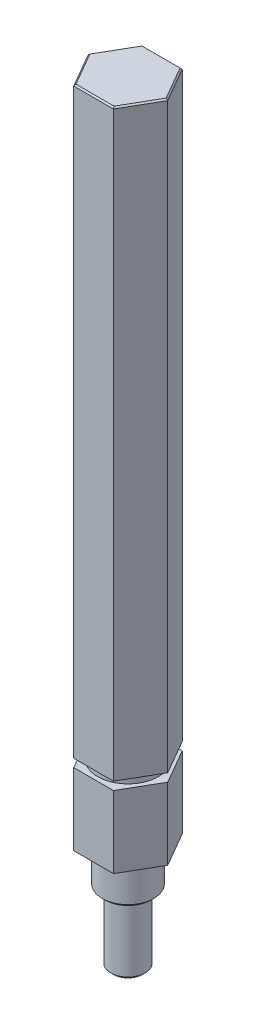
ISO-10303-21;
HEADER;
FILE_DESCRIPTION(('STEP AP214'),'2;1');
FILE_NAME('part.step','',(''),(''),'','','');
FILE_SCHEMA(('AUTOMOTIVE_DESIGN { 1 0 10303 214 1 1 1 1 }'));
ENDSEC;
DATA;
#1=APPLICATION_CONTEXT('core data for automotive mechanical design processes');
#2=APPLICATION_PROTOCOL_DEFINITION('international standard','automotive_design',2000,#1);
#3=PRODUCT_CONTEXT('',#1,'mechanical');
#4=PRODUCT('Part','Part','',(#3));
#5=PRODUCT_RELATED_PRODUCT_CATEGORY('part','',(#4));
#6=PRODUCT_DEFINITION_FORMATION('','',#4);
#7=PRODUCT_DEFINITION_CONTEXT('part definition',#1,'design');
#8=PRODUCT_DEFINITION('design','',#6,#7);
#9=PRODUCT_DEFINITION_SHAPE('','',#8);
#10=(LENGTH_UNIT() NAMED_UNIT(*) SI_UNIT(.MILLI.,.METRE.));
#11=(NAMED_UNIT(*) PLANE_ANGLE_UNIT() SI_UNIT($,.RADIAN.));
#12=(NAMED_UNIT(*) SI_UNIT($,.STERADIAN.) SOLID_ANGLE_UNIT());
#13=UNCERTAINTY_MEASURE_WITH_UNIT(LENGTH_MEASURE(1.E-05),#10,'distance_accuracy_value','');
#14=(GEOMETRIC_REPRESENTATION_CONTEXT(3) GLOBAL_UNCERTAINTY_ASSIGNED_CONTEXT((#13)) GLOBAL_UNIT_ASSIGNED_CONTEXT((#10,
#11,#12)) REPRESENTATION_CONTEXT('',''));
#15=CARTESIAN_POINT('',(0.,0.,0.));
#16=DIRECTION('',(0.,0.,1.));
#17=DIRECTION('',(1.,0.,0.));
#18=AXIS2_PLACEMENT_3D('',#15,#16,#17);
#19=CARTESIAN_POINT('',(-38.3071337161431,-45.212,-16.669011646302));
#20=DIRECTION('',(0.,1.,0.));
#21=DIRECTION('',(0.,0.,1.));
#22=AXIS2_PLACEMENT_3D('',#19,#20,#21);
#23=PLANE('',#22);
#24=CARTESIAN_POINT('',(-38.3071337161431,-45.2119999999923,-16.669011646302));
#25=DIRECTION('',(0.,1.,0.));
#26=DIRECTION('',(0.,0.,1.));
#27=AXIS2_PLACEMENT_3D('',#24,#25,#26);
#28=CIRCLE('',#27,2.65430000009029);
#29=CARTESIAN_POINT('',(-38.3071337161431,-45.2119999999923,-14.0147116462117));
#30=VERTEX_POINT('',#29);
#31=EDGE_CURVE('E19',#30,#30,#28,.T.);
#32=ORIENTED_EDGE('',*,*,#31,.F.);
#33=EDGE_LOOP('',(#32));
#34=FACE_BOUND('',#33,.T.);
#35=ADVANCED_FACE('F16',(#34),#23,.F.);
#36=CARTESIAN_POINT('',(-38.3071337161431,-44.704000000138,-16.669011646302));
#37=DIRECTION('',(0.,1.,0.));
#38=DIRECTION('',(0.,0.,1.));
#39=AXIS2_PLACEMENT_3D('',#36,#37,#38);
#40=CONICAL_SURFACE('',#39,3.16229999994458,0.785398163397448);
#41=CARTESIAN_POINT('',(-38.3071337161431,-44.704,-16.669011646302));
#42=DIRECTION('',(0.,1.,0.));
#43=DIRECTION('',(0.,0.,1.));
#44=AXIS2_PLACEMENT_3D('',#41,#42,#43);
#45=CIRCLE('',#44,3.1623);
#46=CARTESIAN_POINT('',(-38.3071337161431,-44.704,-13.506711646302));
#47=VERTEX_POINT('',#46);
#48=EDGE_CURVE('E178',#47,#47,#45,.T.);
#49=ORIENTED_EDGE('',*,*,#48,.F.);
#50=EDGE_LOOP('',(#49));
#51=FACE_BOUND('',#50,.T.);
#52=ORIENTED_EDGE('',*,*,#31,.T.);
#53=EDGE_LOOP('',(#52));
#54=FACE_BOUND('',#53,.T.);
#55=ADVANCED_FACE('F220',(#51,#54),#40,.T.);
#56=CARTESIAN_POINT('',(-38.3071337161431,-45.212,-16.669011646302));
#57=DIRECTION('',(0.,1.,0.));
#58=DIRECTION('',(0.,0.,1.));
#59=AXIS2_PLACEMENT_3D('',#56,#57,#58);
#60=CYLINDRICAL_SURFACE('',#59,3.1623);
#61=CARTESIAN_POINT('',(-38.3071337161431,-32.512,-16.669011646302));
#62=DIRECTION('',(0.,1.,0.));
#63=DIRECTION('',(0.,0.,1.));
#64=AXIS2_PLACEMENT_3D('',#61,#62,#63);
#65=CIRCLE('',#64,3.1623);
#66=CARTESIAN_POINT('',(-38.3071337161431,-32.512,-13.506711646302));
#67=VERTEX_POINT('',#66);
#68=EDGE_CURVE('E182',#67,#67,#65,.F.);
#69=ORIENTED_EDGE('',*,*,#68,.T.);
#70=EDGE_LOOP('',(#69));
#71=FACE_BOUND('',#70,.T.);
#72=ORIENTED_EDGE('',*,*,#48,.T.);
#73=EDGE_LOOP('',(#72));
#74=FACE_BOUND('',#73,.T.);
#75=ADVANCED_FACE('F204',(#71,#74),#60,.T.);
#76=CARTESIAN_POINT('',(-38.3071337161431,-32.512,-16.669011646302));
#77=DIRECTION('',(0.,1.,0.));
#78=DIRECTION('',(0.,0.,1.));
#79=AXIS2_PLACEMENT_3D('',#76,#77,#78);
#80=PLANE('',#79);
#81=CARTESIAN_POINT('',(-38.3071337161431,-32.511999999997,-16.669011646302));
#82=DIRECTION('',(0.,1.,0.));
#83=DIRECTION('',(0.,0.,1.));
#84=AXIS2_PLACEMENT_3D('',#81,#82,#83);
#85=CIRCLE('',#84,4.24179999994759);
#86=CARTESIAN_POINT('',(-38.3071337161431,-32.511999999997,-12.4272116463544));
#87=VERTEX_POINT('',#86);
#88=EDGE_CURVE('E177',#87,#87,#85,.T.);
#89=ORIENTED_EDGE('',*,*,#88,.F.);
#90=EDGE_LOOP('',(#89));
#91=FACE_BOUND('',#90,.T.);
#92=ORIENTED_EDGE('',*,*,#68,.F.);
#93=EDGE_LOOP('',(#92));
#94=FACE_BOUND('',#93,.T.);
#95=ADVANCED_FACE('F207',(#91,#94),#80,.F.);
#96=CARTESIAN_POINT('',(-38.3071337161431,-32.0039999999722,-16.669011646302));
#97=DIRECTION('',(0.,1.,0.));
#98=DIRECTION('',(0.,0.,1.));
#99=AXIS2_PLACEMENT_3D('',#96,#97,#98);
#100=CONICAL_SURFACE('',#99,4.74979999991557,0.7853981633415);
#101=CARTESIAN_POINT('',(-38.3071337161431,-32.004,-16.669011646302));
#102=DIRECTION('',(0.,1.,0.));
#103=DIRECTION('',(0.,0.,1.));
#104=AXIS2_PLACEMENT_3D('',#101,#102,#103);
#105=CIRCLE('',#104,4.7498);
#106=CARTESIAN_POINT('',(-38.3071337161431,-32.004,-11.919211646302));
#107=VERTEX_POINT('',#106);
#108=EDGE_CURVE('E173',#107,#107,#105,.T.);
#109=ORIENTED_EDGE('',*,*,#108,.F.);
#110=EDGE_LOOP('',(#109));
#111=FACE_BOUND('',#110,.T.);
#112=ORIENTED_EDGE('',*,*,#88,.T.);
#113=EDGE_LOOP('',(#112));
#114=FACE_BOUND('',#113,.T.);
#115=ADVANCED_FACE('F209',(#111,#114),#100,.T.);
#116=CARTESIAN_POINT('',(-38.3071337161431,-32.512,-16.669011646302));
#117=DIRECTION('',(0.,1.,0.));
#118=DIRECTION('',(0.,0.,1.));
#119=AXIS2_PLACEMENT_3D('',#116,#117,#118);
#120=CYLINDRICAL_SURFACE('',#119,4.7498);
#121=CARTESIAN_POINT('',(-38.3071337161431,-25.4,-16.669011646302));
#122=DIRECTION('',(0.,1.,0.));
#123=DIRECTION('',(0.,0.,1.));
#124=AXIS2_PLACEMENT_3D('',#121,#122,#123);
#125=CIRCLE('',#124,4.7498);
#126=CARTESIAN_POINT('',(-38.3071337161431,-25.4,-11.919211646302));
#127=VERTEX_POINT('',#126);
#128=EDGE_CURVE('E152',#127,#127,#125,.F.);
#129=ORIENTED_EDGE('',*,*,#128,.T.);
#130=EDGE_LOOP('',(#129));
#131=FACE_BOUND('',#130,.T.);
#132=ORIENTED_EDGE('',*,*,#108,.T.);
#133=EDGE_LOOP('',(#132));
#134=FACE_BOUND('',#133,.T.);
#135=ADVANCED_FACE('F217',(#131,#134),#120,.T.);
#136=CARTESIAN_POINT('',(-38.3071337161431,-25.4,-3.96901164630201));
#137=DIRECTION('',(0.,1.,0.));
#138=DIRECTION('',(0.,0.,1.));
#139=AXIS2_PLACEMENT_3D('',#136,#137,#138);
#140=PLANE('',#139);
#141=DIRECTION('',(-0.5,0.,0.866025403784439));
#142=VECTOR('',#141,1.);
#143=CARTESIAN_POINT('',(-41.9733079254973,-25.4,-23.019011646302));
#144=LINE('',#143,#142);
#145=CARTESIAN_POINT('',(-41.9733079254973,-25.4,-23.019011646302));
#146=VERTEX_POINT('',#145);
#147=CARTESIAN_POINT('',(-45.6394821348514,-25.4,-16.669011646302));
#148=VERTEX_POINT('',#147);
#149=EDGE_CURVE('E143',#146,#148,#144,.T.);
#150=ORIENTED_EDGE('',*,*,#149,.F.);
#151=DIRECTION('',(-1.,0.,0.));
#152=VECTOR('',#151,1.);
#153=CARTESIAN_POINT('',(-34.640959506789,-25.4,-23.019011646302));
#154=LINE('',#153,#152);
#155=CARTESIAN_POINT('',(-34.640959506789,-25.4,-23.019011646302));
#156=VERTEX_POINT('',#155);
#157=EDGE_CURVE('E139',#156,#146,#154,.T.);
#158=ORIENTED_EDGE('',*,*,#157,.F.);
#159=DIRECTION('',(-0.5,0.,-0.866025403784439));
#160=VECTOR('',#159,1.);
#161=CARTESIAN_POINT('',(-30.9747852974349,-25.4,-16.669011646302));
#162=LINE('',#161,#160);
#163=CARTESIAN_POINT('',(-30.9747852974349,-25.4,-16.669011646302));
#164=VERTEX_POINT('',#163);
#165=EDGE_CURVE('E162',#164,#156,#162,.T.);
#166=ORIENTED_EDGE('',*,*,#165,.F.);
#167=DIRECTION('',(0.500000000000001,0.,-0.866025403784438));
#168=VECTOR('',#167,1.);
#169=CARTESIAN_POINT('',(-34.640959506789,-25.4,-10.319011646302));
#170=LINE('',#169,#168);
#171=CARTESIAN_POINT('',(-34.640959506789,-25.4,-10.319011646302));
#172=VERTEX_POINT('',#171);
#173=EDGE_CURVE('E524',#172,#164,#170,.T.);
#174=ORIENTED_EDGE('',*,*,#173,.F.);
#175=DIRECTION('',(1.,0.,0.));
#176=VECTOR('',#175,1.);
#177=CARTESIAN_POINT('',(-41.9733079254973,-25.4,-10.319011646302));
#178=LINE('',#177,#176);
#179=CARTESIAN_POINT('',(-41.9733079254973,-25.4,-10.319011646302));
#180=VERTEX_POINT('',#179);
#181=EDGE_CURVE('E531',#180,#172,#178,.T.);
#182=ORIENTED_EDGE('',*,*,#181,.F.);
#183=DIRECTION('',(0.5,0.,0.866025403784439));
#184=VECTOR('',#183,1.);
#185=CARTESIAN_POINT('',(-45.6394821348514,-25.4,-16.669011646302));
#186=LINE('',#185,#184);
#187=EDGE_CURVE('E148',#148,#180,#186,.T.);
#188=ORIENTED_EDGE('',*,*,#187,.F.);
#189=EDGE_LOOP('',(#150,#158,#166,#174,#182,#188));
#190=FACE_BOUND('',#189,.T.);
#191=ORIENTED_EDGE('',*,*,#128,.F.);
#192=EDGE_LOOP('',(#191));
#193=FACE_BOUND('',#192,.T.);
#194=ADVANCED_FACE('F145',(#190,#193),#140,.F.);
#195=CARTESIAN_POINT('',(-41.9733079254973,-25.4,-23.019011646302));
#196=DIRECTION('',(-0.866025403784439,0.,-0.5));
#197=DIRECTION('',(-0.5,0.,0.866025403784439));
#198=AXIS2_PLACEMENT_3D('',#195,#196,#197);
#199=PLANE('',#198);
#200=ORIENTED_EDGE('',*,*,#149,.T.);
#201=DIRECTION('',(0.,1.,0.));
#202=VECTOR('',#201,1.);
#203=CARTESIAN_POINT('',(-45.6394821348514,-25.4,-16.669011646302));
#204=LINE('',#203,#202);
#205=CARTESIAN_POINT('',(-45.6394821348514,-12.1158,-16.669011646302));
#206=VERTEX_POINT('',#205);
#207=EDGE_CURVE('E539',#206,#148,#204,.F.);
#208=ORIENTED_EDGE('',*,*,#207,.F.);
#209=DIRECTION('',(0.5,0.,-0.866025403784439));
#210=VECTOR('',#209,1.);
#211=CARTESIAN_POINT('',(-45.6394821348514,-12.1158,-16.669011646302));
#212=LINE('',#211,#210);
#213=CARTESIAN_POINT('',(-41.9733079254973,-12.1158,-23.019011646302));
#214=VERTEX_POINT('',#213);
#215=EDGE_CURVE('E158',#206,#214,#212,.T.);
#216=ORIENTED_EDGE('',*,*,#215,.T.);
#217=DIRECTION('',(0.,1.,0.));
#218=VECTOR('',#217,1.);
#219=CARTESIAN_POINT('',(-41.9733079254973,-25.4,-23.019011646302));
#220=LINE('',#219,#218);
#221=EDGE_CURVE('E155',#146,#214,#220,.T.);
#222=ORIENTED_EDGE('',*,*,#221,.F.);
#223=EDGE_LOOP('',(#200,#208,#216,#222));
#224=FACE_BOUND('',#223,.T.);
#225=ADVANCED_FACE('F156',(#224),#199,.T.);
#226=CARTESIAN_POINT('',(-34.640959506789,-25.4,-23.019011646302));
#227=DIRECTION('',(0.,0.,-1.));
#228=DIRECTION('',(-1.,0.,0.));
#229=AXIS2_PLACEMENT_3D('',#226,#227,#228);
#230=PLANE('',#229);
#231=ORIENTED_EDGE('',*,*,#157,.T.);
#232=ORIENTED_EDGE('',*,*,#221,.T.);
#233=DIRECTION('',(1.,0.,0.));
#234=VECTOR('',#233,1.);
#235=CARTESIAN_POINT('',(-21.7881364409388,-12.1158,-23.019011646302));
#236=LINE('',#235,#234);
#237=CARTESIAN_POINT('',(-34.640959506789,-12.1158,-23.019011646302));
#238=VERTEX_POINT('',#237);
#239=EDGE_CURVE('E554',#214,#238,#236,.T.);
#240=ORIENTED_EDGE('',*,*,#239,.T.);
#241=DIRECTION('',(0.,1.,0.));
#242=VECTOR('',#241,1.);
#243=CARTESIAN_POINT('',(-34.640959506789,-25.4,-23.019011646302));
#244=LINE('',#243,#242);
#245=EDGE_CURVE('E166',#156,#238,#244,.T.);
#246=ORIENTED_EDGE('',*,*,#245,.F.);
#247=EDGE_LOOP('',(#231,#232,#240,#246));
#248=FACE_BOUND('',#247,.T.);
#249=ADVANCED_FACE('F164',(#248),#230,.T.);
#250=CARTESIAN_POINT('',(-30.9747852974349,-25.4,-16.669011646302));
#251=DIRECTION('',(0.866025403784439,0.,-0.5));
#252=DIRECTION('',(-0.5,0.,-0.866025403784439));
#253=AXIS2_PLACEMENT_3D('',#250,#251,#252);
#254=PLANE('',#253);
#255=ORIENTED_EDGE('',*,*,#165,.T.);
#256=ORIENTED_EDGE('',*,*,#245,.T.);
#257=DIRECTION('',(0.5,0.,0.866025403784438));
#258=VECTOR('',#257,1.);
#259=CARTESIAN_POINT('',(-34.640959506789,-12.1158,-23.019011646302));
#260=LINE('',#259,#258);
#261=CARTESIAN_POINT('',(-30.9747852974349,-12.1158,-16.669011646302));
#262=VERTEX_POINT('',#261);
#263=EDGE_CURVE('E557',#238,#262,#260,.T.);
#264=ORIENTED_EDGE('',*,*,#263,.T.);
#265=DIRECTION('',(0.,1.,0.));
#266=VECTOR('',#265,1.);
#267=CARTESIAN_POINT('',(-30.9747852974349,-25.4,-16.669011646302));
#268=LINE('',#267,#266);
#269=EDGE_CURVE('E520',#164,#262,#268,.T.);
#270=ORIENTED_EDGE('',*,*,#269,.F.);
#271=EDGE_LOOP('',(#255,#256,#264,#270));
#272=FACE_BOUND('',#271,.T.);
#273=ADVANCED_FACE('F301',(#272),#254,.T.);
#274=CARTESIAN_POINT('',(-34.640959506789,-25.4,-10.319011646302));
#275=DIRECTION('',(0.866025403784438,0.,0.500000000000001));
#276=DIRECTION('',(0.500000000000001,0.,-0.866025403784438));
#277=AXIS2_PLACEMENT_3D('',#274,#275,#276);
#278=PLANE('',#277);
#279=ORIENTED_EDGE('',*,*,#173,.T.);
#280=ORIENTED_EDGE('',*,*,#269,.T.);
#281=DIRECTION('',(-0.500000000000001,0.,0.866025403784438));
#282=VECTOR('',#281,1.);
#283=CARTESIAN_POINT('',(-30.9747852974349,-12.1158,-16.669011646302));
#284=LINE('',#283,#282);
#285=CARTESIAN_POINT('',(-34.640959506789,-12.1158,-10.319011646302));
#286=VERTEX_POINT('',#285);
#287=EDGE_CURVE('E560',#262,#286,#284,.T.);
#288=ORIENTED_EDGE('',*,*,#287,.T.);
#289=DIRECTION('',(0.,1.,0.));
#290=VECTOR('',#289,1.);
#291=CARTESIAN_POINT('',(-34.640959506789,-25.4,-10.319011646302));
#292=LINE('',#291,#290);
#293=EDGE_CURVE('E535',#172,#286,#292,.T.);
#294=ORIENTED_EDGE('',*,*,#293,.F.);
#295=EDGE_LOOP('',(#279,#280,#288,#294));
#296=FACE_BOUND('',#295,.T.);
#297=ADVANCED_FACE('F297',(#296),#278,.T.);
#298=CARTESIAN_POINT('',(-41.9733079254973,-25.4,-10.319011646302));
#299=DIRECTION('',(0.,0.,1.));
#300=DIRECTION('',(1.,0.,0.));
#301=AXIS2_PLACEMENT_3D('',#298,#299,#300);
#302=PLANE('',#301);
#303=ORIENTED_EDGE('',*,*,#181,.T.);
#304=ORIENTED_EDGE('',*,*,#293,.T.);
#305=DIRECTION('',(1.,0.,0.));
#306=VECTOR('',#305,1.);
#307=CARTESIAN_POINT('',(-21.7881364409388,-12.1158,-10.319011646302));
#308=LINE('',#307,#306);
#309=CARTESIAN_POINT('',(-41.9733079254973,-12.1158,-10.319011646302));
#310=VERTEX_POINT('',#309);
#311=EDGE_CURVE('E563',#286,#310,#308,.F.);
#312=ORIENTED_EDGE('',*,*,#311,.T.);
#313=DIRECTION('',(0.,1.,0.));
#314=VECTOR('',#313,1.);
#315=CARTESIAN_POINT('',(-41.9733079254973,-25.4,-10.319011646302));
#316=LINE('',#315,#314);
#317=EDGE_CURVE('E544',#180,#310,#316,.T.);
#318=ORIENTED_EDGE('',*,*,#317,.F.);
#319=EDGE_LOOP('',(#303,#304,#312,#318));
#320=FACE_BOUND('',#319,.T.);
#321=ADVANCED_FACE('F293',(#320),#302,.T.);
#322=CARTESIAN_POINT('',(-45.6394821348514,-25.4,-16.669011646302));
#323=DIRECTION('',(-0.866025403784439,0.,0.5));
#324=DIRECTION('',(0.5,0.,0.866025403784439));
#325=AXIS2_PLACEMENT_3D('',#322,#323,#324);
#326=PLANE('',#325);
#327=ORIENTED_EDGE('',*,*,#187,.T.);
#328=ORIENTED_EDGE('',*,*,#317,.T.);
#329=DIRECTION('',(-0.5,0.,-0.866025403784438));
#330=VECTOR('',#329,1.);
#331=CARTESIAN_POINT('',(-41.9733079254973,-12.1158,-10.319011646302));
#332=LINE('',#331,#330);
#333=EDGE_CURVE('E566',#310,#206,#332,.T.);
#334=ORIENTED_EDGE('',*,*,#333,.T.);
#335=ORIENTED_EDGE('',*,*,#207,.T.);
#336=EDGE_LOOP('',(#327,#328,#334,#335));
#337=FACE_BOUND('',#336,.T.);
#338=ADVANCED_FACE('F289',(#337),#326,.T.);
#339=CARTESIAN_POINT('',(-38.3071337161451,97.0813400000005,-10.573011646302));
#340=DIRECTION('',(0.,-0.707106781186544,-0.707106781186551));
#341=DIRECTION('',(0.,0.707106781186551,-0.707106781186544));
#342=AXIS2_PLACEMENT_3D('',#339,#340,#341);
#343=PLANE('',#342);
#344=DIRECTION('',(1.,0.,0.));
#345=VECTOR('',#344,1.);
#346=CARTESIAN_POINT('',(-41.9733079254973,96.8273400000005,-10.319011646302));
#347=LINE('',#346,#345);
#348=CARTESIAN_POINT('',(-34.640959506789,96.8273400000005,-10.319011646302));
#349=VERTEX_POINT('',#348);
#350=CARTESIAN_POINT('',(-41.9733079254973,96.8273400000005,-10.319011646302));
#351=VERTEX_POINT('',#350);
#352=EDGE_CURVE('E590',#349,#351,#347,.F.);
#353=ORIENTED_EDGE('',*,*,#352,.F.);
#354=DIRECTION('',(-0.377964473009223,0.654653670707976,-0.654653670707981));
#355=VECTOR('',#354,1.);
#356=CARTESIAN_POINT('',(-34.640959506789,96.8273400000005,-10.319011646302));
#357=LINE('',#356,#355);
#358=CARTESIAN_POINT('',(-34.7876064751632,97.0813400000005,-10.573011646302));
#359=VERTEX_POINT('',#358);
#360=EDGE_CURVE('E548',#349,#359,#357,.T.);
#361=ORIENTED_EDGE('',*,*,#360,.T.);
#362=DIRECTION('',(1.,0.,0.));
#363=VECTOR('',#362,1.);
#364=CARTESIAN_POINT('',(-38.3071337161451,97.0813400000005,-10.573011646302));
#365=LINE('',#364,#363);
#366=CARTESIAN_POINT('',(-41.8266609571231,97.0813400000005,-10.573011646302));
#367=VERTEX_POINT('',#366);
#368=EDGE_CURVE('E577',#367,#359,#365,.T.);
#369=ORIENTED_EDGE('',*,*,#368,.F.);
#370=DIRECTION('',(-0.377964473009255,-0.654653670707976,0.654653670707962));
#371=VECTOR('',#370,1.);
#372=CARTESIAN_POINT('',(-41.8266609571231,97.0813400000005,-10.573011646302));
#373=LINE('',#372,#371);
#374=EDGE_CURVE('E570',#367,#351,#373,.T.);
#375=ORIENTED_EDGE('',*,*,#374,.T.);
#376=EDGE_LOOP('',(#353,#361,#369,#375));
#377=FACE_BOUND('',#376,.T.);
#378=ADVANCED_FACE('F285',(#377),#343,.F.);
#379=CARTESIAN_POINT('',(-33.0278428546734,97.0813400000005,-13.6210116463016));
#380=DIRECTION('',(-0.612372435695796,-0.707106781186546,-0.353553390593275));
#381=DIRECTION('',(0.755928946018453,-0.654653670707979,0.));
#382=AXIS2_PLACEMENT_3D('',#379,#380,#381);
#383=PLANE('',#382);
#384=DIRECTION('',(0.500000000000001,0.,-0.866025403784438));
#385=VECTOR('',#384,1.);
#386=CARTESIAN_POINT('',(-34.7876064751632,97.0813400000005,-10.573011646302));
#387=LINE('',#386,#385);
#388=CARTESIAN_POINT('',(-31.2680792341832,97.0813400000005,-16.669011646302));
#389=VERTEX_POINT('',#388);
#390=EDGE_CURVE('E580',#359,#389,#387,.T.);
#391=ORIENTED_EDGE('',*,*,#390,.F.);
#392=ORIENTED_EDGE('',*,*,#360,.F.);
#393=DIRECTION('',(0.500000000000001,0.,-0.866025403784438));
#394=VECTOR('',#393,1.);
#395=CARTESIAN_POINT('',(-34.640959506789,96.8273400000004,-10.319011646302));
#396=LINE('',#395,#394);
#397=CARTESIAN_POINT('',(-30.9747852974349,96.8273400000005,-16.669011646302));
#398=VERTEX_POINT('',#397);
#399=EDGE_CURVE('E593',#398,#349,#396,.F.);
#400=ORIENTED_EDGE('',*,*,#399,.F.);
#401=DIRECTION('',(0.755928946018445,-0.654653670707988,0.));
#402=VECTOR('',#401,1.);
#403=CARTESIAN_POINT('',(-32.2736584458922,97.952197142858,-16.669011646302));
#404=LINE('',#403,#402);
#405=EDGE_CURVE('E550',#398,#389,#404,.F.);
#406=ORIENTED_EDGE('',*,*,#405,.T.);
#407=EDGE_LOOP('',(#391,#392,#400,#406));
#408=FACE_BOUND('',#407,.T.);
#409=ADVANCED_FACE('F281',(#408),#383,.F.);
#410=CARTESIAN_POINT('',(-33.0278428546739,97.0813400000005,-19.7170116463033));
#411=DIRECTION('',(-0.612372435695803,-0.707106781186538,0.353553390593279));
#412=DIRECTION('',(0.755928946018445,-0.654653670707988,0.));
#413=AXIS2_PLACEMENT_3D('',#410,#411,#412);
#414=PLANE('',#413);
#415=DIRECTION('',(-0.5,0.,-0.866025403784439));
#416=VECTOR('',#415,1.);
#417=CARTESIAN_POINT('',(-31.2680792341832,97.0813400000005,-16.669011646302));
#418=LINE('',#417,#416);
#419=CARTESIAN_POINT('',(-34.7876064751632,97.0813400000005,-22.765011646302));
#420=VERTEX_POINT('',#419);
#421=EDGE_CURVE('E583',#389,#420,#418,.T.);
#422=ORIENTED_EDGE('',*,*,#421,.F.);
#423=ORIENTED_EDGE('',*,*,#405,.F.);
#424=DIRECTION('',(-0.5,0.,-0.866025403784439));
#425=VECTOR('',#424,1.);
#426=CARTESIAN_POINT('',(-30.9747852974349,96.8273400000005,-16.669011646302));
#427=LINE('',#426,#425);
#428=CARTESIAN_POINT('',(-34.640959506789,96.8273400000005,-23.019011646302));
#429=VERTEX_POINT('',#428);
#430=EDGE_CURVE('E600',#429,#398,#427,.F.);
#431=ORIENTED_EDGE('',*,*,#430,.F.);
#432=DIRECTION('',(-0.377964473009211,0.654653670707982,0.654653670707982));
#433=VECTOR('',#432,1.);
#434=CARTESIAN_POINT('',(-34.640959506789,96.8273400000005,-23.019011646302));
#435=LINE('',#434,#433);
#436=EDGE_CURVE('E587',#429,#420,#435,.T.);
#437=ORIENTED_EDGE('',*,*,#436,.T.);
#438=EDGE_LOOP('',(#422,#423,#431,#437));
#439=FACE_BOUND('',#438,.T.);
#440=ADVANCED_FACE('F277',(#439),#414,.F.);
#441=CARTESIAN_POINT('',(-21.7881364409388,-12.1158,-16.669011646302));
#442=DIRECTION('',(0.,-1.,0.));
#443=DIRECTION('',(0.,0.,-1.));
#444=AXIS2_PLACEMENT_3D('',#441,#442,#443);
#445=PLANE('',#444);
#446=ORIENTED_EDGE('',*,*,#311,.F.);
#447=ORIENTED_EDGE('',*,*,#287,.F.);
#448=ORIENTED_EDGE('',*,*,#263,.F.);
#449=ORIENTED_EDGE('',*,*,#239,.F.);
#450=ORIENTED_EDGE('',*,*,#215,.F.);
#451=ORIENTED_EDGE('',*,*,#333,.F.);
#452=EDGE_LOOP('',(#446,#447,#448,#449,#450,#451));
#453=FACE_BOUND('',#452,.T.);
#454=CARTESIAN_POINT('',(-38.3071337161431,-12.1158,-16.669011646302));
#455=DIRECTION('',(0.,1.,0.));
#456=DIRECTION('',(0.,0.,1.));
#457=AXIS2_PLACEMENT_3D('',#454,#455,#456);
#458=CIRCLE('',#457,5.58800000000003);
#459=CARTESIAN_POINT('',(-38.3071337161431,-12.1158,-11.081011646302));
#460=VERTEX_POINT('',#459);
#461=EDGE_CURVE('E189',#460,#460,#458,.T.);
#462=ORIENTED_EDGE('',*,*,#461,.F.);
#463=EDGE_LOOP('',(#462));
#464=FACE_BOUND('',#463,.T.);
#465=ADVANCED_FACE('F273',(#453,#464),#445,.F.);
#466=CARTESIAN_POINT('',(-43.5864245776138,97.0813400000005,-13.6210116463033));
#467=DIRECTION('',(0.612372435695786,-0.707106781186557,-0.353553390593269));
#468=DIRECTION('',(0.755928946018463,0.654653670707967,0.));
#469=AXIS2_PLACEMENT_3D('',#466,#467,#468);
#470=PLANE('',#469);
#471=DIRECTION('',(0.5,0.,0.866025403784439));
#472=VECTOR('',#471,1.);
#473=CARTESIAN_POINT('',(-45.6394821348514,96.8273400000005,-16.669011646302));
#474=LINE('',#473,#472);
#475=CARTESIAN_POINT('',(-45.6394821348514,96.8273400000005,-16.669011646302));
#476=VERTEX_POINT('',#475);
#477=EDGE_CURVE('E609',#351,#476,#474,.F.);
#478=ORIENTED_EDGE('',*,*,#477,.F.);
#479=ORIENTED_EDGE('',*,*,#374,.F.);
#480=DIRECTION('',(0.5,0.,0.866025403784439));
#481=VECTOR('',#480,1.);
#482=CARTESIAN_POINT('',(-45.3461881981031,97.0813400000005,-16.669011646302));
#483=LINE('',#482,#481);
#484=CARTESIAN_POINT('',(-45.346188198103,97.0813400000005,-16.669011646302));
#485=VERTEX_POINT('',#484);
#486=EDGE_CURVE('E574',#485,#367,#483,.T.);
#487=ORIENTED_EDGE('',*,*,#486,.F.);
#488=DIRECTION('',(0.755928946018463,0.654653670707967,0.));
#489=VECTOR('',#488,1.);
#490=CARTESIAN_POINT('',(-44.3406089863949,97.9521971428572,-16.669011646302));
#491=LINE('',#490,#489);
#492=EDGE_CURVE('E572',#476,#485,#491,.T.);
#493=ORIENTED_EDGE('',*,*,#492,.F.);
#494=EDGE_LOOP('',(#478,#479,#487,#493));
#495=FACE_BOUND('',#494,.T.);
#496=ADVANCED_FACE('F269',(#495),#470,.F.);
#497=CARTESIAN_POINT('',(-38.3071337161451,97.0813400000005,-16.6690116463026));
#498=DIRECTION('',(0.,1.,0.));
#499=DIRECTION('',(0.,0.,1.));
#500=AXIS2_PLACEMENT_3D('',#497,#498,#499);
#501=PLANE('',#500);
#502=DIRECTION('',(1.,0.,0.));
#503=VECTOR('',#502,1.);
#504=CARTESIAN_POINT('',(-38.3071337161451,97.0813400000005,-22.765011646302));
#505=LINE('',#504,#503);
#506=CARTESIAN_POINT('',(-41.8266609571231,97.0813400000005,-22.765011646302));
#507=VERTEX_POINT('',#506);
#508=EDGE_CURVE('E585',#420,#507,#505,.F.);
#509=ORIENTED_EDGE('',*,*,#508,.T.);
#510=DIRECTION('',(-0.500000000000001,0.,0.866025403784438));
#511=VECTOR('',#510,1.);
#512=CARTESIAN_POINT('',(-41.8266609571231,97.0813400000005,-22.765011646302));
#513=LINE('',#512,#511);
#514=EDGE_CURVE('E612',#507,#485,#513,.T.);
#515=ORIENTED_EDGE('',*,*,#514,.T.);
#516=ORIENTED_EDGE('',*,*,#486,.T.);
#517=ORIENTED_EDGE('',*,*,#368,.T.);
#518=ORIENTED_EDGE('',*,*,#390,.T.);
#519=ORIENTED_EDGE('',*,*,#421,.T.);
#520=EDGE_LOOP('',(#509,#515,#516,#517,#518,#519));
#521=FACE_BOUND('',#520,.T.);
#522=ADVANCED_FACE('F265',(#521),#501,.T.);
#523=CARTESIAN_POINT('',(-38.3071337161451,97.0813400000005,-22.765011646302));
#524=DIRECTION('',(0.,-0.707106781186551,0.707106781186544));
#525=DIRECTION('',(0.,-0.707106781186544,-0.707106781186551));
#526=AXIS2_PLACEMENT_3D('',#523,#524,#525);
#527=PLANE('',#526);
#528=DIRECTION('',(-1.,0.,0.));
#529=VECTOR('',#528,1.);
#530=CARTESIAN_POINT('',(-34.640959506789,96.8273400000005,-23.019011646302));
#531=LINE('',#530,#529);
#532=CARTESIAN_POINT('',(-41.9733079254973,96.8273400000005,-23.019011646302));
#533=VERTEX_POINT('',#532);
#534=EDGE_CURVE('E618',#533,#429,#531,.F.);
#535=ORIENTED_EDGE('',*,*,#534,.F.);
#536=DIRECTION('',(0.377964473009259,0.654653670707977,0.654653670707959));
#537=VECTOR('',#536,1.);
#538=CARTESIAN_POINT('',(-41.9733079254973,96.8273400000005,-23.019011646302));
#539=LINE('',#538,#537);
#540=EDGE_CURVE('E615',#533,#507,#539,.T.);
#541=ORIENTED_EDGE('',*,*,#540,.T.);
#542=ORIENTED_EDGE('',*,*,#508,.F.);
#543=ORIENTED_EDGE('',*,*,#436,.F.);
#544=EDGE_LOOP('',(#535,#541,#542,#543));
#545=FACE_BOUND('',#544,.T.);
#546=ADVANCED_FACE('F261',(#545),#527,.F.);
#547=CARTESIAN_POINT('',(-41.9733079254973,-25.4,-10.319011646302));
#548=DIRECTION('',(0.,0.,1.));
#549=DIRECTION('',(1.,0.,0.));
#550=AXIS2_PLACEMENT_3D('',#547,#548,#549);
#551=PLANE('',#550);
#552=DIRECTION('',(0.,1.,0.));
#553=VECTOR('',#552,1.);
#554=CARTESIAN_POINT('',(-41.9733079254973,-25.4,-10.319011646302));
#555=LINE('',#554,#553);
#556=CARTESIAN_POINT('',(-41.9733079254973,-10.6172,-10.319011646302));
#557=VERTEX_POINT('',#556);
#558=EDGE_CURVE('E193',#557,#351,#555,.T.);
#559=ORIENTED_EDGE('',*,*,#558,.F.);
#560=DIRECTION('',(1.,0.,0.));
#561=VECTOR('',#560,1.);
#562=CARTESIAN_POINT('',(-32.7191337161431,-10.6172,-10.319011646302));
#563=LINE('',#562,#561);
#564=CARTESIAN_POINT('',(-34.640959506789,-10.6172,-10.319011646302));
#565=VERTEX_POINT('',#564);
#566=EDGE_CURVE('E630',#557,#565,#563,.T.);
#567=ORIENTED_EDGE('',*,*,#566,.T.);
#568=DIRECTION('',(0.,1.,0.));
#569=VECTOR('',#568,1.);
#570=CARTESIAN_POINT('',(-34.640959506789,-25.4,-10.319011646302));
#571=LINE('',#570,#569);
#572=EDGE_CURVE('E596',#349,#565,#571,.F.);
#573=ORIENTED_EDGE('',*,*,#572,.F.);
#574=ORIENTED_EDGE('',*,*,#352,.T.);
#575=EDGE_LOOP('',(#559,#567,#573,#574));
#576=FACE_BOUND('',#575,.T.);
#577=ADVANCED_FACE('F257',(#576),#551,.T.);
#578=CARTESIAN_POINT('',(-34.640959506789,-25.4,-10.319011646302));
#579=DIRECTION('',(0.866025403784438,0.,0.500000000000001));
#580=DIRECTION('',(0.500000000000001,0.,-0.866025403784438));
#581=AXIS2_PLACEMENT_3D('',#578,#579,#580);
#582=PLANE('',#581);
#583=ORIENTED_EDGE('',*,*,#572,.T.);
#584=DIRECTION('',(0.500000000000001,0.,-0.866025403784438));
#585=VECTOR('',#584,1.);
#586=CARTESIAN_POINT('',(-34.640959506789,-10.6172,-10.319011646302));
#587=LINE('',#586,#585);
#588=CARTESIAN_POINT('',(-30.9747852974349,-10.6172,-16.669011646302));
#589=VERTEX_POINT('',#588);
#590=EDGE_CURVE('E633',#565,#589,#587,.T.);
#591=ORIENTED_EDGE('',*,*,#590,.T.);
#592=DIRECTION('',(0.,1.,0.));
#593=VECTOR('',#592,1.);
#594=CARTESIAN_POINT('',(-30.9747852974349,-25.4,-16.669011646302));
#595=LINE('',#594,#593);
#596=EDGE_CURVE('E194',#398,#589,#595,.F.);
#597=ORIENTED_EDGE('',*,*,#596,.F.);
#598=ORIENTED_EDGE('',*,*,#399,.T.);
#599=EDGE_LOOP('',(#583,#591,#597,#598));
#600=FACE_BOUND('',#599,.T.);
#601=ADVANCED_FACE('F253',(#600),#582,.T.);
#602=CARTESIAN_POINT('',(-30.9747852974349,-25.4,-16.669011646302));
#603=DIRECTION('',(0.866025403784439,0.,-0.5));
#604=DIRECTION('',(-0.5,0.,-0.866025403784439));
#605=AXIS2_PLACEMENT_3D('',#602,#603,#604);
#606=PLANE('',#605);
#607=ORIENTED_EDGE('',*,*,#596,.T.);
#608=DIRECTION('',(-0.5,0.,-0.866025403784438));
#609=VECTOR('',#608,1.);
#610=CARTESIAN_POINT('',(-30.9747852974349,-10.6172,-16.669011646302));
#611=LINE('',#610,#609);
#612=CARTESIAN_POINT('',(-34.640959506789,-10.6172,-23.019011646302));
#613=VERTEX_POINT('',#612);
#614=EDGE_CURVE('E188',#589,#613,#611,.T.);
#615=ORIENTED_EDGE('',*,*,#614,.T.);
#616=DIRECTION('',(0.,1.,0.));
#617=VECTOR('',#616,1.);
#618=CARTESIAN_POINT('',(-34.640959506789,-25.4,-23.019011646302));
#619=LINE('',#618,#617);
#620=EDGE_CURVE('E621',#429,#613,#619,.F.);
#621=ORIENTED_EDGE('',*,*,#620,.F.);
#622=ORIENTED_EDGE('',*,*,#430,.T.);
#623=EDGE_LOOP('',(#607,#615,#621,#622));
#624=FACE_BOUND('',#623,.T.);
#625=ADVANCED_FACE('F249',(#624),#606,.T.);
#626=CARTESIAN_POINT('',(-38.3071337161431,-25.4,-16.669011646302));
#627=DIRECTION('',(0.,1.,0.));
#628=DIRECTION('',(0.,0.,1.));
#629=AXIS2_PLACEMENT_3D('',#626,#627,#628);
#630=CYLINDRICAL_SURFACE('',#629,5.58800000000003);
#631=CARTESIAN_POINT('',(-38.3071337161431,-10.6172,-16.669011646302));
#632=DIRECTION('',(0.,1.,0.));
#633=DIRECTION('',(0.,0.,1.));
#634=AXIS2_PLACEMENT_3D('',#631,#632,#633);
#635=CIRCLE('',#634,5.58800000000003);
#636=CARTESIAN_POINT('',(-38.3071337161431,-10.6172,-11.081011646302));
#637=VERTEX_POINT('',#636);
#638=EDGE_CURVE('E183',#637,#637,#635,.F.);
#639=ORIENTED_EDGE('',*,*,#638,.T.);
#640=EDGE_LOOP('',(#639));
#641=FACE_BOUND('',#640,.T.);
#642=ORIENTED_EDGE('',*,*,#461,.T.);
#643=EDGE_LOOP('',(#642));
#644=FACE_BOUND('',#643,.T.);
#645=ADVANCED_FACE('F245',(#641,#644),#630,.T.);
#646=CARTESIAN_POINT('',(-45.6394821348514,-25.4,-16.669011646302));
#647=DIRECTION('',(-0.866025403784439,0.,0.5));
#648=DIRECTION('',(0.5,0.,0.866025403784439));
#649=AXIS2_PLACEMENT_3D('',#646,#647,#648);
#650=PLANE('',#649);
#651=DIRECTION('',(0.,1.,0.));
#652=VECTOR('',#651,1.);
#653=CARTESIAN_POINT('',(-45.6394821348514,-25.4,-16.669011646302));
#654=LINE('',#653,#652);
#655=CARTESIAN_POINT('',(-45.6394821348514,-10.6172,-16.669011646302));
#656=VERTEX_POINT('',#655);
#657=EDGE_CURVE('E187',#656,#476,#654,.T.);
#658=ORIENTED_EDGE('',*,*,#657,.F.);
#659=DIRECTION('',(0.5,0.,0.866025403784438));
#660=VECTOR('',#659,1.);
#661=CARTESIAN_POINT('',(-45.6394821348514,-10.6172,-16.669011646302));
#662=LINE('',#661,#660);
#663=EDGE_CURVE('E626',#656,#557,#662,.T.);
#664=ORIENTED_EDGE('',*,*,#663,.T.);
#665=ORIENTED_EDGE('',*,*,#558,.T.);
#666=ORIENTED_EDGE('',*,*,#477,.T.);
#667=EDGE_LOOP('',(#658,#664,#665,#666));
#668=FACE_BOUND('',#667,.T.);
#669=ADVANCED_FACE('F241',(#668),#650,.T.);
#670=CARTESIAN_POINT('',(-43.5864245776133,97.0813400000005,-19.7170116463016));
#671=DIRECTION('',(0.612372435695792,-0.70710678118655,0.353553390593273));
#672=DIRECTION('',(0.755928946018457,0.654653670707975,0.));
#673=AXIS2_PLACEMENT_3D('',#670,#671,#672);
#674=PLANE('',#673);
#675=DIRECTION('',(-0.5,0.,0.866025403784439));
#676=VECTOR('',#675,1.);
#677=CARTESIAN_POINT('',(-41.9733079254973,96.8273400000005,-23.019011646302));
#678=LINE('',#677,#676);
#679=EDGE_CURVE('E642',#476,#533,#678,.F.);
#680=ORIENTED_EDGE('',*,*,#679,.F.);
#681=ORIENTED_EDGE('',*,*,#492,.T.);
#682=ORIENTED_EDGE('',*,*,#514,.F.);
#683=ORIENTED_EDGE('',*,*,#540,.F.);
#684=EDGE_LOOP('',(#680,#681,#682,#683));
#685=FACE_BOUND('',#684,.T.);
#686=ADVANCED_FACE('F238',(#685),#674,.F.);
#687=CARTESIAN_POINT('',(-34.640959506789,-25.4,-23.019011646302));
#688=DIRECTION('',(0.,0.,-1.));
#689=DIRECTION('',(-1.,0.,0.));
#690=AXIS2_PLACEMENT_3D('',#687,#688,#689);
#691=PLANE('',#690);
#692=ORIENTED_EDGE('',*,*,#620,.T.);
#693=DIRECTION('',(1.,0.,0.));
#694=VECTOR('',#693,1.);
#695=CARTESIAN_POINT('',(-32.7191337161431,-10.6172,-23.019011646302));
#696=LINE('',#695,#694);
#697=CARTESIAN_POINT('',(-41.9733079254973,-10.6172,-23.019011646302));
#698=VERTEX_POINT('',#697);
#699=EDGE_CURVE('E39',#613,#698,#696,.F.);
#700=ORIENTED_EDGE('',*,*,#699,.T.);
#701=DIRECTION('',(0.,1.,0.));
#702=VECTOR('',#701,1.);
#703=CARTESIAN_POINT('',(-41.9733079254973,-25.4,-23.019011646302));
#704=LINE('',#703,#702);
#705=EDGE_CURVE('E26',#533,#698,#704,.F.);
#706=ORIENTED_EDGE('',*,*,#705,.F.);
#707=ORIENTED_EDGE('',*,*,#534,.T.);
#708=EDGE_LOOP('',(#692,#700,#706,#707));
#709=FACE_BOUND('',#708,.T.);
#710=ADVANCED_FACE('F231',(#709),#691,.T.);
#711=CARTESIAN_POINT('',(-32.7191337161431,-10.6172,-16.669011646302));
#712=DIRECTION('',(0.,1.,0.));
#713=DIRECTION('',(0.,0.,1.));
#714=AXIS2_PLACEMENT_3D('',#711,#712,#713);
#715=PLANE('',#714);
#716=ORIENTED_EDGE('',*,*,#638,.F.);
#717=EDGE_LOOP('',(#716));
#718=FACE_BOUND('',#717,.T.);
#719=ORIENTED_EDGE('',*,*,#590,.F.);
#720=ORIENTED_EDGE('',*,*,#566,.F.);
#721=ORIENTED_EDGE('',*,*,#663,.F.);
#722=DIRECTION('',(-0.5,0.,0.866025403784439));
#723=VECTOR('',#722,1.);
#724=CARTESIAN_POINT('',(-41.9733079254973,-10.6172,-23.019011646302));
#725=LINE('',#724,#723);
#726=EDGE_CURVE('E11',#698,#656,#725,.T.);
#727=ORIENTED_EDGE('',*,*,#726,.F.);
#728=ORIENTED_EDGE('',*,*,#699,.F.);
#729=ORIENTED_EDGE('',*,*,#614,.F.);
#730=EDGE_LOOP('',(#719,#720,#721,#727,#728,#729));
#731=FACE_BOUND('',#730,.T.);
#732=ADVANCED_FACE('F225',(#718,#731),#715,.F.);
#733=CARTESIAN_POINT('',(-41.9733079254973,-25.4,-23.019011646302));
#734=DIRECTION('',(-0.866025403784439,0.,-0.5));
#735=DIRECTION('',(-0.5,0.,0.866025403784439));
#736=AXIS2_PLACEMENT_3D('',#733,#734,#735);
#737=PLANE('',#736);
#738=ORIENTED_EDGE('',*,*,#705,.T.);
#739=ORIENTED_EDGE('',*,*,#726,.T.);
#740=ORIENTED_EDGE('',*,*,#657,.T.);
#741=ORIENTED_EDGE('',*,*,#679,.T.);
#742=EDGE_LOOP('',(#738,#739,#740,#741));
#743=FACE_BOUND('',#742,.T.);
#744=ADVANCED_FACE('F223',(#743),#737,.T.);
#745=CLOSED_SHELL('',(#35,#55,#75,#95,#115,#135,#194,#225,#249,#273,#297,#321,#338,#378,#409,
#440,#465,#496,#522,#546,#577,#601,#625,#645,#669,#686,#710,#732,#744));
#746=MANIFOLD_SOLID_BREP('B1',#745);
#747=ADVANCED_BREP_SHAPE_REPRESENTATION('',(#18,#746),#14);
#748=SHAPE_DEFINITION_REPRESENTATION(#9,#747);
ENDSEC;
END-ISO-10303-21;
